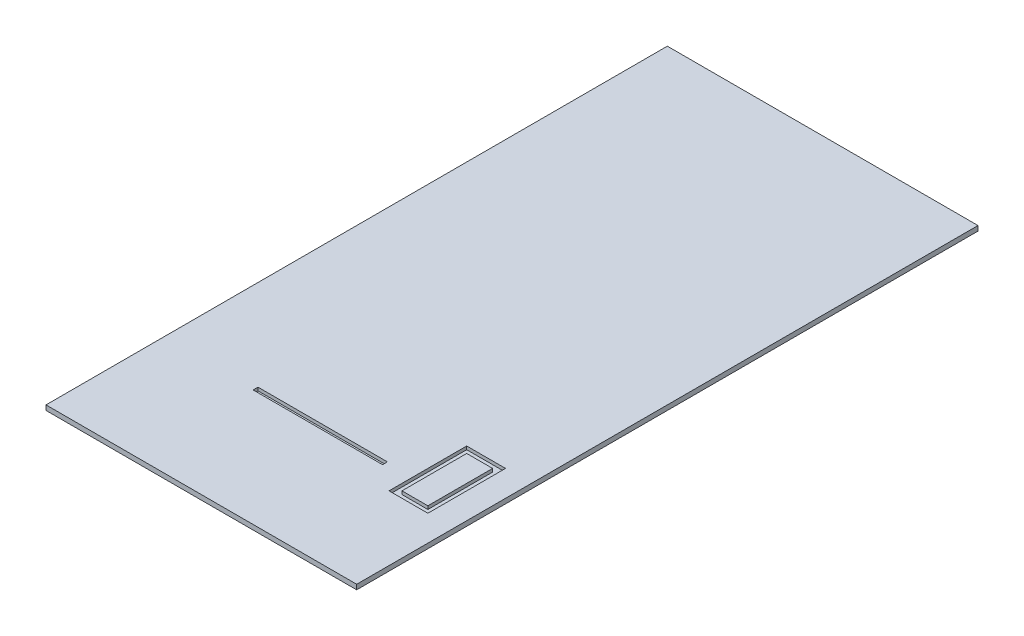
ISO-10303-21;
HEADER;
FILE_DESCRIPTION(('STEP AP214'),'2;1');
FILE_NAME('part.step','',(''),(''),'','','');
FILE_SCHEMA(('AUTOMOTIVE_DESIGN { 1 0 10303 214 1 1 1 1 }'));
ENDSEC;
DATA;
#1=APPLICATION_CONTEXT('core data for automotive mechanical design processes');
#2=APPLICATION_PROTOCOL_DEFINITION('international standard','automotive_design',2000,#1);
#3=PRODUCT_CONTEXT('',#1,'mechanical');
#4=PRODUCT('Part','Part','',(#3));
#5=PRODUCT_RELATED_PRODUCT_CATEGORY('part','',(#4));
#6=PRODUCT_DEFINITION_FORMATION('','',#4);
#7=PRODUCT_DEFINITION_CONTEXT('part definition',#1,'design');
#8=PRODUCT_DEFINITION('design','',#6,#7);
#9=PRODUCT_DEFINITION_SHAPE('','',#8);
#10=(LENGTH_UNIT() NAMED_UNIT(*) SI_UNIT(.MILLI.,.METRE.));
#11=(NAMED_UNIT(*) PLANE_ANGLE_UNIT() SI_UNIT($,.RADIAN.));
#12=(NAMED_UNIT(*) SI_UNIT($,.STERADIAN.) SOLID_ANGLE_UNIT());
#13=UNCERTAINTY_MEASURE_WITH_UNIT(LENGTH_MEASURE(1.E-05),#10,'distance_accuracy_value','');
#14=(GEOMETRIC_REPRESENTATION_CONTEXT(3) GLOBAL_UNCERTAINTY_ASSIGNED_CONTEXT((#13)) GLOBAL_UNIT_ASSIGNED_CONTEXT((#10,
#11,#12)) REPRESENTATION_CONTEXT('',''));
#15=CARTESIAN_POINT('',(0.,0.,0.));
#16=DIRECTION('',(0.,0.,1.));
#17=DIRECTION('',(1.,0.,0.));
#18=AXIS2_PLACEMENT_3D('',#15,#16,#17);
#19=CARTESIAN_POINT('',(609.6,19.05,1219.2));
#20=DIRECTION('',(-1.,0.,0.));
#21=DIRECTION('',(0.,0.,1.));
#22=AXIS2_PLACEMENT_3D('',#19,#20,#21);
#23=PLANE('',#22);
#24=DIRECTION('',(0.,0.,-1.));
#25=VECTOR('',#24,1.);
#26=CARTESIAN_POINT('',(609.6,0.,1219.2));
#27=LINE('',#26,#25);
#28=CARTESIAN_POINT('',(609.6,0.,1219.2));
#29=VERTEX_POINT('',#28);
#30=CARTESIAN_POINT('',(609.6,0.,-1219.2));
#31=VERTEX_POINT('',#30);
#32=EDGE_CURVE('E244',#29,#31,#27,.T.);
#33=ORIENTED_EDGE('',*,*,#32,.T.);
#34=DIRECTION('',(0.,-1.,0.));
#35=VECTOR('',#34,1.);
#36=CARTESIAN_POINT('',(609.6,19.05,-1219.2));
#37=LINE('',#36,#35);
#38=CARTESIAN_POINT('',(609.6,19.05,-1219.2));
#39=VERTEX_POINT('',#38);
#40=EDGE_CURVE('E11',#39,#31,#37,.T.);
#41=ORIENTED_EDGE('',*,*,#40,.F.);
#42=DIRECTION('',(0.,0.,-1.));
#43=VECTOR('',#42,1.);
#44=CARTESIAN_POINT('',(609.6,19.05,1219.2));
#45=LINE('',#44,#43);
#46=CARTESIAN_POINT('',(609.6,19.05,1219.2));
#47=VERTEX_POINT('',#46);
#48=EDGE_CURVE('E250',#47,#39,#45,.T.);
#49=ORIENTED_EDGE('',*,*,#48,.F.);
#50=DIRECTION('',(0.,-1.,0.));
#51=VECTOR('',#50,1.);
#52=CARTESIAN_POINT('',(609.6,19.05,1219.2));
#53=LINE('',#52,#51);
#54=EDGE_CURVE('E260',#47,#29,#53,.T.);
#55=ORIENTED_EDGE('',*,*,#54,.T.);
#56=EDGE_LOOP('',(#33,#41,#49,#55));
#57=FACE_BOUND('',#56,.T.);
#58=ADVANCED_FACE('F36',(#57),#23,.F.);
#59=CARTESIAN_POINT('',(-609.6,19.05,-1219.2));
#60=DIRECTION('',(0.,0.,1.));
#61=DIRECTION('',(1.,0.,0.));
#62=AXIS2_PLACEMENT_3D('',#59,#60,#61);
#63=PLANE('',#62);
#64=DIRECTION('',(-1.,0.,0.));
#65=VECTOR('',#64,1.);
#66=CARTESIAN_POINT('',(-609.6,0.,-1219.2));
#67=LINE('',#66,#65);
#68=CARTESIAN_POINT('',(-609.6,0.,-1219.2));
#69=VERTEX_POINT('',#68);
#70=EDGE_CURVE('E263',#31,#69,#67,.T.);
#71=ORIENTED_EDGE('',*,*,#70,.T.);
#72=DIRECTION('',(0.,-1.,0.));
#73=VECTOR('',#72,1.);
#74=CARTESIAN_POINT('',(-609.6,19.05,-1219.2));
#75=LINE('',#74,#73);
#76=CARTESIAN_POINT('',(-609.6,19.05,-1219.2));
#77=VERTEX_POINT('',#76);
#78=EDGE_CURVE('E43',#77,#69,#75,.T.);
#79=ORIENTED_EDGE('',*,*,#78,.F.);
#80=DIRECTION('',(-1.,0.,0.));
#81=VECTOR('',#80,1.);
#82=CARTESIAN_POINT('',(-609.6,19.05,-1219.2));
#83=LINE('',#82,#81);
#84=EDGE_CURVE('E253',#39,#77,#83,.T.);
#85=ORIENTED_EDGE('',*,*,#84,.F.);
#86=ORIENTED_EDGE('',*,*,#40,.T.);
#87=EDGE_LOOP('',(#71,#79,#85,#86));
#88=FACE_BOUND('',#87,.T.);
#89=ADVANCED_FACE('F293',(#88),#63,.F.);
#90=CARTESIAN_POINT('',(-609.6,19.05,1219.2));
#91=DIRECTION('',(1.,0.,0.));
#92=DIRECTION('',(0.,0.,-1.));
#93=AXIS2_PLACEMENT_3D('',#90,#91,#92);
#94=PLANE('',#93);
#95=DIRECTION('',(0.,0.,1.));
#96=VECTOR('',#95,1.);
#97=CARTESIAN_POINT('',(-609.6,0.,1219.2));
#98=LINE('',#97,#96);
#99=CARTESIAN_POINT('',(-609.6,0.,1219.2));
#100=VERTEX_POINT('',#99);
#101=EDGE_CURVE('E265',#69,#100,#98,.T.);
#102=ORIENTED_EDGE('',*,*,#101,.T.);
#103=DIRECTION('',(0.,-1.,0.));
#104=VECTOR('',#103,1.);
#105=CARTESIAN_POINT('',(-609.6,19.05,1219.2));
#106=LINE('',#105,#104);
#107=CARTESIAN_POINT('',(-609.6,19.05,1219.2));
#108=VERTEX_POINT('',#107);
#109=EDGE_CURVE('E270',#108,#100,#106,.T.);
#110=ORIENTED_EDGE('',*,*,#109,.F.);
#111=DIRECTION('',(0.,0.,1.));
#112=VECTOR('',#111,1.);
#113=CARTESIAN_POINT('',(-609.6,19.05,1219.2));
#114=LINE('',#113,#112);
#115=EDGE_CURVE('E256',#77,#108,#114,.T.);
#116=ORIENTED_EDGE('',*,*,#115,.F.);
#117=ORIENTED_EDGE('',*,*,#78,.T.);
#118=EDGE_LOOP('',(#102,#110,#116,#117));
#119=FACE_BOUND('',#118,.T.);
#120=ADVANCED_FACE('F277',(#119),#94,.F.);
#121=CARTESIAN_POINT('',(-609.6,19.05,1219.2));
#122=DIRECTION('',(0.,0.,-1.));
#123=DIRECTION('',(-1.,0.,0.));
#124=AXIS2_PLACEMENT_3D('',#121,#122,#123);
#125=PLANE('',#124);
#126=DIRECTION('',(1.,0.,0.));
#127=VECTOR('',#126,1.);
#128=CARTESIAN_POINT('',(-609.6,0.,1219.2));
#129=LINE('',#128,#127);
#130=EDGE_CURVE('E254',#100,#29,#129,.T.);
#131=ORIENTED_EDGE('',*,*,#130,.T.);
#132=ORIENTED_EDGE('',*,*,#54,.F.);
#133=DIRECTION('',(1.,0.,0.));
#134=VECTOR('',#133,1.);
#135=CARTESIAN_POINT('',(-609.6,19.05,1219.2));
#136=LINE('',#135,#134);
#137=EDGE_CURVE('E258',#108,#47,#136,.T.);
#138=ORIENTED_EDGE('',*,*,#137,.F.);
#139=ORIENTED_EDGE('',*,*,#109,.T.);
#140=EDGE_LOOP('',(#131,#132,#138,#139));
#141=FACE_BOUND('',#140,.T.);
#142=ADVANCED_FACE('F286',(#141),#125,.F.);
#143=CARTESIAN_POINT('',(0.,19.05,0.));
#144=DIRECTION('',(0.,-1.,0.));
#145=DIRECTION('',(0.,0.,-1.));
#146=AXIS2_PLACEMENT_3D('',#143,#144,#145);
#147=PLANE('',#146);
#148=DIRECTION('',(1.,0.,0.));
#149=VECTOR('',#148,1.);
#150=CARTESIAN_POINT('',(-254.,19.05,762.));
#151=LINE('',#150,#149);
#152=CARTESIAN_POINT('',(-254.,19.05,762.));
#153=VERTEX_POINT('',#152);
#154=CARTESIAN_POINT('',(254.,19.05,762.));
#155=VERTEX_POINT('',#154);
#156=EDGE_CURVE('E177',#153,#155,#151,.T.);
#157=ORIENTED_EDGE('',*,*,#156,.F.);
#158=DIRECTION('',(0.,0.,1.));
#159=VECTOR('',#158,1.);
#160=CARTESIAN_POINT('',(-254.,19.05,742.95));
#161=LINE('',#160,#159);
#162=CARTESIAN_POINT('',(-254.,19.05,742.95));
#163=VERTEX_POINT('',#162);
#164=EDGE_CURVE('E50',#163,#153,#161,.T.);
#165=ORIENTED_EDGE('',*,*,#164,.F.);
#166=DIRECTION('',(-1.,0.,0.));
#167=VECTOR('',#166,1.);
#168=CARTESIAN_POINT('',(-254.,19.05,742.95));
#169=LINE('',#168,#167);
#170=CARTESIAN_POINT('',(254.,19.05,742.95));
#171=VERTEX_POINT('',#170);
#172=EDGE_CURVE('E168',#171,#163,#169,.T.);
#173=ORIENTED_EDGE('',*,*,#172,.F.);
#174=DIRECTION('',(0.,0.,-1.));
#175=VECTOR('',#174,1.);
#176=CARTESIAN_POINT('',(254.,19.05,742.95));
#177=LINE('',#176,#175);
#178=EDGE_CURVE('E171',#155,#171,#177,.T.);
#179=ORIENTED_EDGE('',*,*,#178,.F.);
#180=EDGE_LOOP('',(#157,#165,#173,#179));
#181=FACE_BOUND('',#180,.T.);
#182=DIRECTION('',(-1.,0.,0.));
#183=VECTOR('',#182,1.);
#184=CARTESIAN_POINT('',(508.,19.05,533.4));
#185=LINE('',#184,#183);
#186=CARTESIAN_POINT('',(508.,19.05,533.4));
#187=VERTEX_POINT('',#186);
#188=CARTESIAN_POINT('',(355.6,19.05,533.4));
#189=VERTEX_POINT('',#188);
#190=EDGE_CURVE('E234',#187,#189,#185,.T.);
#191=ORIENTED_EDGE('',*,*,#190,.F.);
#192=DIRECTION('',(0.,0.,-1.));
#193=VECTOR('',#192,1.);
#194=CARTESIAN_POINT('',(508.,19.05,838.2));
#195=LINE('',#194,#193);
#196=CARTESIAN_POINT('',(508.,19.05,838.2));
#197=VERTEX_POINT('',#196);
#198=EDGE_CURVE('E58',#197,#187,#195,.T.);
#199=ORIENTED_EDGE('',*,*,#198,.F.);
#200=DIRECTION('',(1.,0.,0.));
#201=VECTOR('',#200,1.);
#202=CARTESIAN_POINT('',(508.,19.05,838.2));
#203=LINE('',#202,#201);
#204=CARTESIAN_POINT('',(355.6,19.05,838.2));
#205=VERTEX_POINT('',#204);
#206=EDGE_CURVE('E223',#205,#197,#203,.T.);
#207=ORIENTED_EDGE('',*,*,#206,.F.);
#208=DIRECTION('',(0.,0.,1.));
#209=VECTOR('',#208,1.);
#210=CARTESIAN_POINT('',(355.6,19.05,838.2));
#211=LINE('',#210,#209);
#212=EDGE_CURVE('E237',#189,#205,#211,.T.);
#213=ORIENTED_EDGE('',*,*,#212,.F.);
#214=EDGE_LOOP('',(#191,#199,#207,#213));
#215=FACE_BOUND('',#214,.T.);
#216=ORIENTED_EDGE('',*,*,#48,.T.);
#217=ORIENTED_EDGE('',*,*,#84,.T.);
#218=ORIENTED_EDGE('',*,*,#115,.T.);
#219=ORIENTED_EDGE('',*,*,#137,.T.);
#220=EDGE_LOOP('',(#216,#217,#218,#219));
#221=FACE_BOUND('',#220,.T.);
#222=ADVANCED_FACE('F292',(#181,#215,#221),#147,.F.);
#223=CARTESIAN_POINT('',(0.,0.,0.));
#224=DIRECTION('',(0.,-1.,0.));
#225=DIRECTION('',(0.,0.,-1.));
#226=AXIS2_PLACEMENT_3D('',#223,#224,#225);
#227=PLANE('',#226);
#228=ORIENTED_EDGE('',*,*,#32,.F.);
#229=ORIENTED_EDGE('',*,*,#130,.F.);
#230=ORIENTED_EDGE('',*,*,#101,.F.);
#231=ORIENTED_EDGE('',*,*,#70,.F.);
#232=EDGE_LOOP('',(#228,#229,#230,#231));
#233=FACE_BOUND('',#232,.T.);
#234=ADVANCED_FACE('F283',(#233),#227,.T.);
#235=CARTESIAN_POINT('',(508.,6.35,838.2));
#236=DIRECTION('',(1.,0.,0.));
#237=DIRECTION('',(0.,0.,-1.));
#238=AXIS2_PLACEMENT_3D('',#235,#236,#237);
#239=PLANE('',#238);
#240=ORIENTED_EDGE('',*,*,#198,.T.);
#241=DIRECTION('',(0.,1.,0.));
#242=VECTOR('',#241,1.);
#243=CARTESIAN_POINT('',(508.,6.35,533.4));
#244=LINE('',#243,#242);
#245=CARTESIAN_POINT('',(508.,6.35,533.4));
#246=VERTEX_POINT('',#245);
#247=EDGE_CURVE('E232',#246,#187,#244,.T.);
#248=ORIENTED_EDGE('',*,*,#247,.F.);
#249=DIRECTION('',(0.,0.,-1.));
#250=VECTOR('',#249,1.);
#251=CARTESIAN_POINT('',(508.,6.35,838.2));
#252=LINE('',#251,#250);
#253=CARTESIAN_POINT('',(508.,6.35,838.2));
#254=VERTEX_POINT('',#253);
#255=EDGE_CURVE('E219',#254,#246,#252,.T.);
#256=ORIENTED_EDGE('',*,*,#255,.F.);
#257=DIRECTION('',(0.,1.,0.));
#258=VECTOR('',#257,1.);
#259=CARTESIAN_POINT('',(508.,6.35,838.2));
#260=LINE('',#259,#258);
#261=EDGE_CURVE('E242',#254,#197,#260,.T.);
#262=ORIENTED_EDGE('',*,*,#261,.T.);
#263=EDGE_LOOP('',(#240,#248,#256,#262));
#264=FACE_BOUND('',#263,.T.);
#265=ADVANCED_FACE('F305',(#264),#239,.F.);
#266=CARTESIAN_POINT('',(508.,6.35,838.2));
#267=DIRECTION('',(0.,0.,1.));
#268=DIRECTION('',(1.,0.,0.));
#269=AXIS2_PLACEMENT_3D('',#266,#267,#268);
#270=PLANE('',#269);
#271=ORIENTED_EDGE('',*,*,#206,.T.);
#272=ORIENTED_EDGE('',*,*,#261,.F.);
#273=DIRECTION('',(1.,0.,0.));
#274=VECTOR('',#273,1.);
#275=CARTESIAN_POINT('',(508.,6.35,838.2));
#276=LINE('',#275,#274);
#277=CARTESIAN_POINT('',(355.6,6.35,838.2));
#278=VERTEX_POINT('',#277);
#279=EDGE_CURVE('E229',#278,#254,#276,.T.);
#280=ORIENTED_EDGE('',*,*,#279,.F.);
#281=DIRECTION('',(0.,1.,0.));
#282=VECTOR('',#281,1.);
#283=CARTESIAN_POINT('',(355.6,6.35,838.2));
#284=LINE('',#283,#282);
#285=EDGE_CURVE('E245',#278,#205,#284,.T.);
#286=ORIENTED_EDGE('',*,*,#285,.T.);
#287=EDGE_LOOP('',(#271,#272,#280,#286));
#288=FACE_BOUND('',#287,.T.);
#289=ADVANCED_FACE('F312',(#288),#270,.F.);
#290=CARTESIAN_POINT('',(355.6,6.35,838.2));
#291=DIRECTION('',(-1.,0.,0.));
#292=DIRECTION('',(0.,0.,1.));
#293=AXIS2_PLACEMENT_3D('',#290,#291,#292);
#294=PLANE('',#293);
#295=ORIENTED_EDGE('',*,*,#212,.T.);
#296=ORIENTED_EDGE('',*,*,#285,.F.);
#297=DIRECTION('',(0.,0.,1.));
#298=VECTOR('',#297,1.);
#299=CARTESIAN_POINT('',(355.6,6.35,838.2));
#300=LINE('',#299,#298);
#301=CARTESIAN_POINT('',(355.6,6.35,533.4));
#302=VERTEX_POINT('',#301);
#303=EDGE_CURVE('E226',#302,#278,#300,.T.);
#304=ORIENTED_EDGE('',*,*,#303,.F.);
#305=DIRECTION('',(0.,1.,0.));
#306=VECTOR('',#305,1.);
#307=CARTESIAN_POINT('',(355.6,6.35,533.4));
#308=LINE('',#307,#306);
#309=EDGE_CURVE('E247',#302,#189,#308,.T.);
#310=ORIENTED_EDGE('',*,*,#309,.T.);
#311=EDGE_LOOP('',(#295,#296,#304,#310));
#312=FACE_BOUND('',#311,.T.);
#313=ADVANCED_FACE('F317',(#312),#294,.F.);
#314=CARTESIAN_POINT('',(508.,6.35,533.4));
#315=DIRECTION('',(0.,0.,-1.));
#316=DIRECTION('',(-1.,0.,0.));
#317=AXIS2_PLACEMENT_3D('',#314,#315,#316);
#318=PLANE('',#317);
#319=ORIENTED_EDGE('',*,*,#190,.T.);
#320=ORIENTED_EDGE('',*,*,#309,.F.);
#321=DIRECTION('',(-1.,0.,0.));
#322=VECTOR('',#321,1.);
#323=CARTESIAN_POINT('',(508.,6.35,533.4));
#324=LINE('',#323,#322);
#325=EDGE_CURVE('E222',#246,#302,#324,.T.);
#326=ORIENTED_EDGE('',*,*,#325,.F.);
#327=ORIENTED_EDGE('',*,*,#247,.T.);
#328=EDGE_LOOP('',(#319,#320,#326,#327));
#329=FACE_BOUND('',#328,.T.);
#330=ADVANCED_FACE('F313',(#329),#318,.F.);
#331=CARTESIAN_POINT('',(0.,6.35,0.));
#332=DIRECTION('',(0.,1.,0.));
#333=DIRECTION('',(0.,0.,1.));
#334=AXIS2_PLACEMENT_3D('',#331,#332,#333);
#335=PLANE('',#334);
#336=DIRECTION('',(1.,0.,0.));
#337=VECTOR('',#336,1.);
#338=CARTESIAN_POINT('',(482.6,6.35,812.8));
#339=LINE('',#338,#337);
#340=CARTESIAN_POINT('',(381.,6.35,812.8));
#341=VERTEX_POINT('',#340);
#342=CARTESIAN_POINT('',(482.6,6.35,812.8));
#343=VERTEX_POINT('',#342);
#344=EDGE_CURVE('E197',#341,#343,#339,.T.);
#345=ORIENTED_EDGE('',*,*,#344,.F.);
#346=DIRECTION('',(0.,0.,1.));
#347=VECTOR('',#346,1.);
#348=CARTESIAN_POINT('',(381.,6.35,812.8));
#349=LINE('',#348,#347);
#350=CARTESIAN_POINT('',(381.,6.35,558.8));
#351=VERTEX_POINT('',#350);
#352=EDGE_CURVE('E194',#351,#341,#349,.T.);
#353=ORIENTED_EDGE('',*,*,#352,.F.);
#354=DIRECTION('',(-1.,0.,0.));
#355=VECTOR('',#354,1.);
#356=CARTESIAN_POINT('',(482.6,6.35,558.8));
#357=LINE('',#356,#355);
#358=CARTESIAN_POINT('',(482.6,6.35,558.8));
#359=VERTEX_POINT('',#358);
#360=EDGE_CURVE('E190',#359,#351,#357,.T.);
#361=ORIENTED_EDGE('',*,*,#360,.F.);
#362=DIRECTION('',(0.,0.,-1.));
#363=VECTOR('',#362,1.);
#364=CARTESIAN_POINT('',(482.6,6.35,812.8));
#365=LINE('',#364,#363);
#366=EDGE_CURVE('E187',#343,#359,#365,.T.);
#367=ORIENTED_EDGE('',*,*,#366,.F.);
#368=EDGE_LOOP('',(#345,#353,#361,#367));
#369=FACE_BOUND('',#368,.T.);
#370=ORIENTED_EDGE('',*,*,#255,.T.);
#371=ORIENTED_EDGE('',*,*,#325,.T.);
#372=ORIENTED_EDGE('',*,*,#303,.T.);
#373=ORIENTED_EDGE('',*,*,#279,.T.);
#374=EDGE_LOOP('',(#370,#371,#372,#373));
#375=FACE_BOUND('',#374,.T.);
#376=ADVANCED_FACE('F316',(#369,#375),#335,.T.);
#377=CARTESIAN_POINT('',(482.6,6.35,812.8));
#378=DIRECTION('',(1.,0.,0.));
#379=DIRECTION('',(0.,0.,-1.));
#380=AXIS2_PLACEMENT_3D('',#377,#378,#379);
#381=PLANE('',#380);
#382=DIRECTION('',(0.,0.,-1.));
#383=VECTOR('',#382,1.);
#384=CARTESIAN_POINT('',(482.6,19.05,812.8));
#385=LINE('',#384,#383);
#386=CARTESIAN_POINT('',(482.6,19.05,812.8));
#387=VERTEX_POINT('',#386);
#388=CARTESIAN_POINT('',(482.6,19.05,558.8));
#389=VERTEX_POINT('',#388);
#390=EDGE_CURVE('E183',#387,#389,#385,.T.);
#391=ORIENTED_EDGE('',*,*,#390,.F.);
#392=DIRECTION('',(0.,1.,0.));
#393=VECTOR('',#392,1.);
#394=CARTESIAN_POINT('',(482.6,6.35,812.8));
#395=LINE('',#394,#393);
#396=EDGE_CURVE('E211',#343,#387,#395,.T.);
#397=ORIENTED_EDGE('',*,*,#396,.F.);
#398=ORIENTED_EDGE('',*,*,#366,.T.);
#399=DIRECTION('',(0.,1.,0.));
#400=VECTOR('',#399,1.);
#401=CARTESIAN_POINT('',(482.6,6.35,558.8));
#402=LINE('',#401,#400);
#403=EDGE_CURVE('E200',#359,#389,#402,.T.);
#404=ORIENTED_EDGE('',*,*,#403,.T.);
#405=EDGE_LOOP('',(#391,#397,#398,#404));
#406=FACE_BOUND('',#405,.T.);
#407=ADVANCED_FACE('F327',(#406),#381,.T.);
#408=CARTESIAN_POINT('',(482.6,6.35,812.8));
#409=DIRECTION('',(0.,0.,1.));
#410=DIRECTION('',(1.,0.,0.));
#411=AXIS2_PLACEMENT_3D('',#408,#409,#410);
#412=PLANE('',#411);
#413=DIRECTION('',(1.,0.,0.));
#414=VECTOR('',#413,1.);
#415=CARTESIAN_POINT('',(482.6,19.05,812.8));
#416=LINE('',#415,#414);
#417=CARTESIAN_POINT('',(381.,19.05,812.8));
#418=VERTEX_POINT('',#417);
#419=EDGE_CURVE('E191',#418,#387,#416,.T.);
#420=ORIENTED_EDGE('',*,*,#419,.F.);
#421=DIRECTION('',(0.,1.,0.));
#422=VECTOR('',#421,1.);
#423=CARTESIAN_POINT('',(381.,6.35,812.8));
#424=LINE('',#423,#422);
#425=EDGE_CURVE('E213',#341,#418,#424,.T.);
#426=ORIENTED_EDGE('',*,*,#425,.F.);
#427=ORIENTED_EDGE('',*,*,#344,.T.);
#428=ORIENTED_EDGE('',*,*,#396,.T.);
#429=EDGE_LOOP('',(#420,#426,#427,#428));
#430=FACE_BOUND('',#429,.T.);
#431=ADVANCED_FACE('F331',(#430),#412,.T.);
#432=CARTESIAN_POINT('',(381.,6.35,812.8));
#433=DIRECTION('',(-1.,0.,0.));
#434=DIRECTION('',(0.,0.,1.));
#435=AXIS2_PLACEMENT_3D('',#432,#433,#434);
#436=PLANE('',#435);
#437=DIRECTION('',(0.,0.,1.));
#438=VECTOR('',#437,1.);
#439=CARTESIAN_POINT('',(381.,19.05,812.8));
#440=LINE('',#439,#438);
#441=CARTESIAN_POINT('',(381.,19.05,558.8));
#442=VERTEX_POINT('',#441);
#443=EDGE_CURVE('E206',#442,#418,#440,.T.);
#444=ORIENTED_EDGE('',*,*,#443,.F.);
#445=DIRECTION('',(0.,1.,0.));
#446=VECTOR('',#445,1.);
#447=CARTESIAN_POINT('',(381.,6.35,558.8));
#448=LINE('',#447,#446);
#449=EDGE_CURVE('E215',#351,#442,#448,.T.);
#450=ORIENTED_EDGE('',*,*,#449,.F.);
#451=ORIENTED_EDGE('',*,*,#352,.T.);
#452=ORIENTED_EDGE('',*,*,#425,.T.);
#453=EDGE_LOOP('',(#444,#450,#451,#452));
#454=FACE_BOUND('',#453,.T.);
#455=ADVANCED_FACE('F336',(#454),#436,.T.);
#456=CARTESIAN_POINT('',(482.6,6.35,558.8));
#457=DIRECTION('',(0.,0.,-1.));
#458=DIRECTION('',(-1.,0.,0.));
#459=AXIS2_PLACEMENT_3D('',#456,#457,#458);
#460=PLANE('',#459);
#461=DIRECTION('',(-1.,0.,0.));
#462=VECTOR('',#461,1.);
#463=CARTESIAN_POINT('',(482.6,19.05,558.8));
#464=LINE('',#463,#462);
#465=EDGE_CURVE('E203',#389,#442,#464,.T.);
#466=ORIENTED_EDGE('',*,*,#465,.F.);
#467=ORIENTED_EDGE('',*,*,#403,.F.);
#468=ORIENTED_EDGE('',*,*,#360,.T.);
#469=ORIENTED_EDGE('',*,*,#449,.T.);
#470=EDGE_LOOP('',(#466,#467,#468,#469));
#471=FACE_BOUND('',#470,.T.);
#472=ADVANCED_FACE('F333',(#471),#460,.T.);
#473=ORIENTED_EDGE('',*,*,#390,.T.);
#474=ORIENTED_EDGE('',*,*,#465,.T.);
#475=ORIENTED_EDGE('',*,*,#443,.T.);
#476=ORIENTED_EDGE('',*,*,#419,.T.);
#477=EDGE_LOOP('',(#473,#474,#475,#476));
#478=FACE_BOUND('',#477,.T.);
#479=ADVANCED_FACE('F309',(#478),#147,.F.);
#480=CARTESIAN_POINT('',(-254.,6.35,742.95));
#481=DIRECTION('',(-1.,0.,0.));
#482=DIRECTION('',(0.,0.,1.));
#483=AXIS2_PLACEMENT_3D('',#480,#481,#482);
#484=PLANE('',#483);
#485=ORIENTED_EDGE('',*,*,#164,.T.);
#486=DIRECTION('',(0.,1.,0.));
#487=VECTOR('',#486,1.);
#488=CARTESIAN_POINT('',(-254.,6.35,762.));
#489=LINE('',#488,#487);
#490=CARTESIAN_POINT('',(-254.,6.35,762.));
#491=VERTEX_POINT('',#490);
#492=EDGE_CURVE('E146',#491,#153,#489,.T.);
#493=ORIENTED_EDGE('',*,*,#492,.F.);
#494=DIRECTION('',(0.,0.,1.));
#495=VECTOR('',#494,1.);
#496=CARTESIAN_POINT('',(-254.,6.35,742.95));
#497=LINE('',#496,#495);
#498=CARTESIAN_POINT('',(-254.,6.35,742.95));
#499=VERTEX_POINT('',#498);
#500=EDGE_CURVE('E150',#499,#491,#497,.T.);
#501=ORIENTED_EDGE('',*,*,#500,.F.);
#502=DIRECTION('',(0.,1.,0.));
#503=VECTOR('',#502,1.);
#504=CARTESIAN_POINT('',(-254.,6.35,742.95));
#505=LINE('',#504,#503);
#506=EDGE_CURVE('E181',#499,#163,#505,.T.);
#507=ORIENTED_EDGE('',*,*,#506,.T.);
#508=EDGE_LOOP('',(#485,#493,#501,#507));
#509=FACE_BOUND('',#508,.T.);
#510=ADVANCED_FACE('F148',(#509),#484,.F.);
#511=CARTESIAN_POINT('',(-254.,6.35,742.95));
#512=DIRECTION('',(0.,0.,-1.));
#513=DIRECTION('',(-1.,0.,0.));
#514=AXIS2_PLACEMENT_3D('',#511,#512,#513);
#515=PLANE('',#514);
#516=ORIENTED_EDGE('',*,*,#172,.T.);
#517=ORIENTED_EDGE('',*,*,#506,.F.);
#518=DIRECTION('',(-1.,0.,0.));
#519=VECTOR('',#518,1.);
#520=CARTESIAN_POINT('',(-254.,6.35,742.95));
#521=LINE('',#520,#519);
#522=CARTESIAN_POINT('',(254.,6.35,742.95));
#523=VERTEX_POINT('',#522);
#524=EDGE_CURVE('E156',#523,#499,#521,.T.);
#525=ORIENTED_EDGE('',*,*,#524,.F.);
#526=DIRECTION('',(0.,1.,0.));
#527=VECTOR('',#526,1.);
#528=CARTESIAN_POINT('',(254.,6.35,742.95));
#529=LINE('',#528,#527);
#530=EDGE_CURVE('E184',#523,#171,#529,.T.);
#531=ORIENTED_EDGE('',*,*,#530,.T.);
#532=EDGE_LOOP('',(#516,#517,#525,#531));
#533=FACE_BOUND('',#532,.T.);
#534=ADVANCED_FACE('F346',(#533),#515,.F.);
#535=CARTESIAN_POINT('',(254.,6.35,742.95));
#536=DIRECTION('',(1.,0.,0.));
#537=DIRECTION('',(0.,0.,-1.));
#538=AXIS2_PLACEMENT_3D('',#535,#536,#537);
#539=PLANE('',#538);
#540=ORIENTED_EDGE('',*,*,#178,.T.);
#541=ORIENTED_EDGE('',*,*,#530,.F.);
#542=DIRECTION('',(0.,0.,-1.));
#543=VECTOR('',#542,1.);
#544=CARTESIAN_POINT('',(254.,6.35,742.95));
#545=LINE('',#544,#543);
#546=CARTESIAN_POINT('',(254.,6.35,762.));
#547=VERTEX_POINT('',#546);
#548=EDGE_CURVE('E164',#547,#523,#545,.T.);
#549=ORIENTED_EDGE('',*,*,#548,.F.);
#550=DIRECTION('',(0.,1.,0.));
#551=VECTOR('',#550,1.);
#552=CARTESIAN_POINT('',(254.,6.35,762.));
#553=LINE('',#552,#551);
#554=EDGE_CURVE('E155',#547,#155,#553,.T.);
#555=ORIENTED_EDGE('',*,*,#554,.T.);
#556=EDGE_LOOP('',(#540,#541,#549,#555));
#557=FACE_BOUND('',#556,.T.);
#558=ADVANCED_FACE('F349',(#557),#539,.F.);
#559=CARTESIAN_POINT('',(-254.,6.35,762.));
#560=DIRECTION('',(0.,0.,1.));
#561=DIRECTION('',(1.,0.,0.));
#562=AXIS2_PLACEMENT_3D('',#559,#560,#561);
#563=PLANE('',#562);
#564=ORIENTED_EDGE('',*,*,#156,.T.);
#565=ORIENTED_EDGE('',*,*,#554,.F.);
#566=DIRECTION('',(1.,0.,0.));
#567=VECTOR('',#566,1.);
#568=CARTESIAN_POINT('',(-254.,6.35,762.));
#569=LINE('',#568,#567);
#570=EDGE_CURVE('E159',#491,#547,#569,.T.);
#571=ORIENTED_EDGE('',*,*,#570,.F.);
#572=ORIENTED_EDGE('',*,*,#492,.T.);
#573=EDGE_LOOP('',(#564,#565,#571,#572));
#574=FACE_BOUND('',#573,.T.);
#575=ADVANCED_FACE('F160',(#574),#563,.F.);
#576=CARTESIAN_POINT('',(0.,6.35,0.));
#577=DIRECTION('',(0.,1.,0.));
#578=DIRECTION('',(0.,0.,1.));
#579=AXIS2_PLACEMENT_3D('',#576,#577,#578);
#580=PLANE('',#579);
#581=ORIENTED_EDGE('',*,*,#500,.T.);
#582=ORIENTED_EDGE('',*,*,#570,.T.);
#583=ORIENTED_EDGE('',*,*,#548,.T.);
#584=ORIENTED_EDGE('',*,*,#524,.T.);
#585=EDGE_LOOP('',(#581,#582,#583,#584));
#586=FACE_BOUND('',#585,.T.);
#587=ADVANCED_FACE('F166',(#586),#580,.T.);
#588=CLOSED_SHELL('',(#58,#89,#120,#142,#222,#234,#265,#289,#313,#330,#376,#407,#431,#455,#472,
#479,#510,#534,#558,#575,#587));
#589=MANIFOLD_SOLID_BREP('B2',#588);
#590=ADVANCED_BREP_SHAPE_REPRESENTATION('',(#18,#589),#14);
#591=SHAPE_DEFINITION_REPRESENTATION(#9,#590);
ENDSEC;
END-ISO-10303-21;
